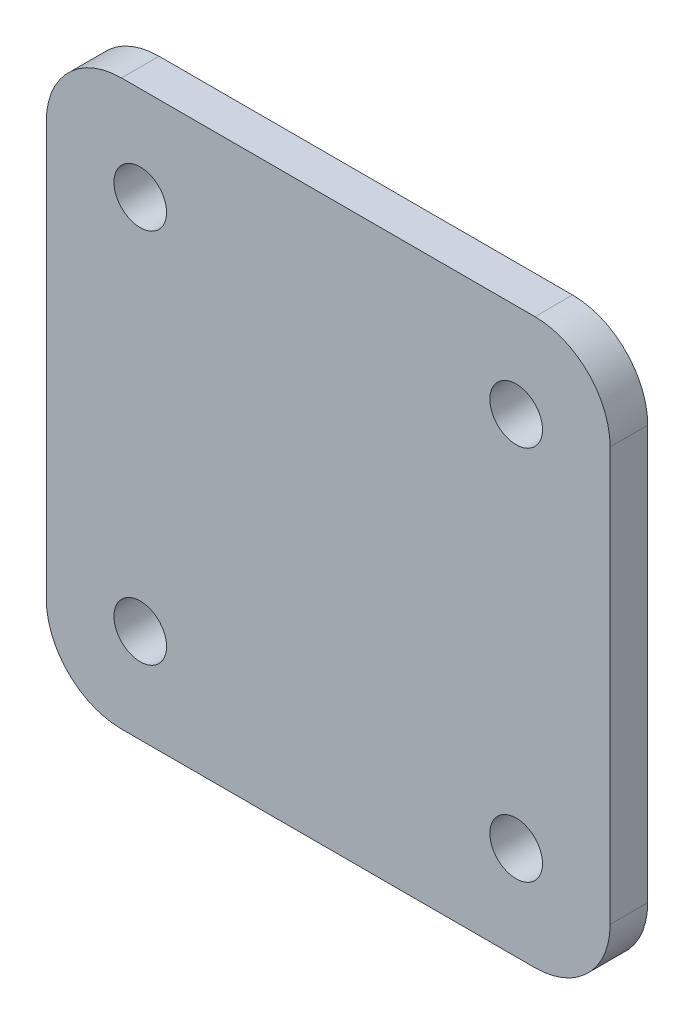
ISO-10303-21;
HEADER;
FILE_DESCRIPTION(('STEP AP214'),'2;1');
FILE_NAME('part.step','',(''),(''),'','','');
FILE_SCHEMA(('AUTOMOTIVE_DESIGN { 1 0 10303 214 1 1 1 1 }'));
ENDSEC;
DATA;
#1=APPLICATION_CONTEXT('core data for automotive mechanical design processes');
#2=APPLICATION_PROTOCOL_DEFINITION('international standard','automotive_design',2000,#1);
#3=PRODUCT_CONTEXT('',#1,'mechanical');
#4=PRODUCT('Part','Part','',(#3));
#5=PRODUCT_RELATED_PRODUCT_CATEGORY('part','',(#4));
#6=PRODUCT_DEFINITION_FORMATION('','',#4);
#7=PRODUCT_DEFINITION_CONTEXT('part definition',#1,'design');
#8=PRODUCT_DEFINITION('design','',#6,#7);
#9=PRODUCT_DEFINITION_SHAPE('','',#8);
#10=(LENGTH_UNIT() NAMED_UNIT(*) SI_UNIT(.MILLI.,.METRE.));
#11=(NAMED_UNIT(*) PLANE_ANGLE_UNIT() SI_UNIT($,.RADIAN.));
#12=(NAMED_UNIT(*) SI_UNIT($,.STERADIAN.) SOLID_ANGLE_UNIT());
#13=UNCERTAINTY_MEASURE_WITH_UNIT(LENGTH_MEASURE(1.E-05),#10,'distance_accuracy_value','');
#14=(GEOMETRIC_REPRESENTATION_CONTEXT(3) GLOBAL_UNCERTAINTY_ASSIGNED_CONTEXT((#13)) GLOBAL_UNIT_ASSIGNED_CONTEXT((#10,
#11,#12)) REPRESENTATION_CONTEXT('',''));
#15=CARTESIAN_POINT('',(0.,0.,0.));
#16=DIRECTION('',(0.,0.,1.));
#17=DIRECTION('',(1.,0.,0.));
#18=AXIS2_PLACEMENT_3D('',#15,#16,#17);
#19=CARTESIAN_POINT('',(-37.5,37.5,5.));
#20=DIRECTION('',(1.,0.,0.));
#21=DIRECTION('',(0.,1.,0.));
#22=AXIS2_PLACEMENT_3D('',#19,#20,#21);
#23=PLANE('',#22);
#24=DIRECTION('',(0.,-1.,0.));
#25=VECTOR('',#24,1.);
#26=CARTESIAN_POINT('',(-37.5,37.5,5.));
#27=LINE('',#26,#25);
#28=CARTESIAN_POINT('',(-37.5,27.5,5.));
#29=VERTEX_POINT('',#28);
#30=CARTESIAN_POINT('',(-37.5,-27.5,5.));
#31=VERTEX_POINT('',#30);
#32=EDGE_CURVE('E133',#29,#31,#27,.T.);
#33=ORIENTED_EDGE('',*,*,#32,.F.);
#34=DIRECTION('',(0.,0.,-1.));
#35=VECTOR('',#34,1.);
#36=CARTESIAN_POINT('',(-37.5,27.5,5.));
#37=LINE('',#36,#35);
#38=CARTESIAN_POINT('',(-37.5,27.5,0.));
#39=VERTEX_POINT('',#38);
#40=EDGE_CURVE('E118',#29,#39,#37,.T.);
#41=ORIENTED_EDGE('',*,*,#40,.T.);
#42=DIRECTION('',(0.,-1.,0.));
#43=VECTOR('',#42,1.);
#44=CARTESIAN_POINT('',(-37.5,37.5,0.));
#45=LINE('',#44,#43);
#46=CARTESIAN_POINT('',(-37.5,-27.5,0.));
#47=VERTEX_POINT('',#46);
#48=EDGE_CURVE('E130',#39,#47,#45,.T.);
#49=ORIENTED_EDGE('',*,*,#48,.T.);
#50=DIRECTION('',(0.,0.,-1.));
#51=VECTOR('',#50,1.);
#52=CARTESIAN_POINT('',(-37.5,-27.5,5.));
#53=LINE('',#52,#51);
#54=EDGE_CURVE('E135',#47,#31,#53,.F.);
#55=ORIENTED_EDGE('',*,*,#54,.T.);
#56=EDGE_LOOP('',(#33,#41,#49,#55));
#57=FACE_BOUND('',#56,.T.);
#58=ADVANCED_FACE('F48',(#57),#23,.F.);
#59=CARTESIAN_POINT('',(-37.5,-37.5,5.));
#60=DIRECTION('',(0.,1.,0.));
#61=DIRECTION('',(-1.,0.,0.));
#62=AXIS2_PLACEMENT_3D('',#59,#60,#61);
#63=PLANE('',#62);
#64=DIRECTION('',(1.,0.,0.));
#65=VECTOR('',#64,1.);
#66=CARTESIAN_POINT('',(-37.5,-37.5,5.));
#67=LINE('',#66,#65);
#68=CARTESIAN_POINT('',(-27.5,-37.5,5.));
#69=VERTEX_POINT('',#68);
#70=CARTESIAN_POINT('',(27.5,-37.5,5.));
#71=VERTEX_POINT('',#70);
#72=EDGE_CURVE('E179',#69,#71,#67,.T.);
#73=ORIENTED_EDGE('',*,*,#72,.F.);
#74=DIRECTION('',(0.,0.,-1.));
#75=VECTOR('',#74,1.);
#76=CARTESIAN_POINT('',(-27.5,-37.5,5.));
#77=LINE('',#76,#75);
#78=CARTESIAN_POINT('',(-27.5,-37.5,0.));
#79=VERTEX_POINT('',#78);
#80=EDGE_CURVE('E172',#69,#79,#77,.T.);
#81=ORIENTED_EDGE('',*,*,#80,.T.);
#82=DIRECTION('',(1.,0.,0.));
#83=VECTOR('',#82,1.);
#84=CARTESIAN_POINT('',(-37.5,-37.5,0.));
#85=LINE('',#84,#83);
#86=CARTESIAN_POINT('',(27.5,-37.5,0.));
#87=VERTEX_POINT('',#86);
#88=EDGE_CURVE('E139',#79,#87,#85,.T.);
#89=ORIENTED_EDGE('',*,*,#88,.T.);
#90=DIRECTION('',(0.,0.,-1.));
#91=VECTOR('',#90,1.);
#92=CARTESIAN_POINT('',(27.5,-37.5,5.));
#93=LINE('',#92,#91);
#94=EDGE_CURVE('E170',#87,#71,#93,.F.);
#95=ORIENTED_EDGE('',*,*,#94,.T.);
#96=EDGE_LOOP('',(#73,#81,#89,#95));
#97=FACE_BOUND('',#96,.T.);
#98=ADVANCED_FACE('F177',(#97),#63,.F.);
#99=CARTESIAN_POINT('',(37.5,37.5,5.));
#100=DIRECTION('',(-1.,0.,0.));
#101=DIRECTION('',(0.,0.,1.));
#102=AXIS2_PLACEMENT_3D('',#99,#100,#101);
#103=PLANE('',#102);
#104=DIRECTION('',(0.,1.,0.));
#105=VECTOR('',#104,1.);
#106=CARTESIAN_POINT('',(37.5,37.5,5.));
#107=LINE('',#106,#105);
#108=CARTESIAN_POINT('',(37.5,-27.5,5.));
#109=VERTEX_POINT('',#108);
#110=CARTESIAN_POINT('',(37.5,27.5,5.));
#111=VERTEX_POINT('',#110);
#112=EDGE_CURVE('E187',#109,#111,#107,.T.);
#113=ORIENTED_EDGE('',*,*,#112,.F.);
#114=DIRECTION('',(0.,0.,-1.));
#115=VECTOR('',#114,1.);
#116=CARTESIAN_POINT('',(37.5,-27.5,5.));
#117=LINE('',#116,#115);
#118=CARTESIAN_POINT('',(37.5,-27.5,0.));
#119=VERTEX_POINT('',#118);
#120=EDGE_CURVE('E13',#109,#119,#117,.T.);
#121=ORIENTED_EDGE('',*,*,#120,.T.);
#122=DIRECTION('',(0.,1.,0.));
#123=VECTOR('',#122,1.);
#124=CARTESIAN_POINT('',(37.5,37.5,0.));
#125=LINE('',#124,#123);
#126=CARTESIAN_POINT('',(37.5,27.5,0.));
#127=VERTEX_POINT('',#126);
#128=EDGE_CURVE('E143',#119,#127,#125,.T.);
#129=ORIENTED_EDGE('',*,*,#128,.T.);
#130=DIRECTION('',(0.,0.,-1.));
#131=VECTOR('',#130,1.);
#132=CARTESIAN_POINT('',(37.5,27.5,5.));
#133=LINE('',#132,#131);
#134=EDGE_CURVE('E56',#127,#111,#133,.F.);
#135=ORIENTED_EDGE('',*,*,#134,.T.);
#136=EDGE_LOOP('',(#113,#121,#129,#135));
#137=FACE_BOUND('',#136,.T.);
#138=ADVANCED_FACE('F186',(#137),#103,.F.);
#139=CARTESIAN_POINT('',(-37.5,37.5,5.));
#140=DIRECTION('',(0.,-1.,0.));
#141=DIRECTION('',(1.,0.,0.));
#142=AXIS2_PLACEMENT_3D('',#139,#140,#141);
#143=PLANE('',#142);
#144=DIRECTION('',(-1.,0.,0.));
#145=VECTOR('',#144,1.);
#146=CARTESIAN_POINT('',(-37.5,37.5,0.));
#147=LINE('',#146,#145);
#148=CARTESIAN_POINT('',(27.5,37.5,0.));
#149=VERTEX_POINT('',#148);
#150=CARTESIAN_POINT('',(-27.5,37.5,0.));
#151=VERTEX_POINT('',#150);
#152=EDGE_CURVE('E153',#149,#151,#147,.T.);
#153=ORIENTED_EDGE('',*,*,#152,.T.);
#154=DIRECTION('',(0.,0.,-1.));
#155=VECTOR('',#154,1.);
#156=CARTESIAN_POINT('',(-27.5,37.5,5.));
#157=LINE('',#156,#155);
#158=CARTESIAN_POINT('',(-27.5,37.5,5.));
#159=VERTEX_POINT('',#158);
#160=EDGE_CURVE('E119',#151,#159,#157,.F.);
#161=ORIENTED_EDGE('',*,*,#160,.T.);
#162=DIRECTION('',(-1.,0.,0.));
#163=VECTOR('',#162,1.);
#164=CARTESIAN_POINT('',(-37.5,37.5,5.));
#165=LINE('',#164,#163);
#166=CARTESIAN_POINT('',(27.5,37.5,5.));
#167=VERTEX_POINT('',#166);
#168=EDGE_CURVE('E149',#167,#159,#165,.T.);
#169=ORIENTED_EDGE('',*,*,#168,.F.);
#170=DIRECTION('',(0.,0.,-1.));
#171=VECTOR('',#170,1.);
#172=CARTESIAN_POINT('',(27.5,37.5,5.));
#173=LINE('',#172,#171);
#174=EDGE_CURVE('E124',#167,#149,#173,.T.);
#175=ORIENTED_EDGE('',*,*,#174,.T.);
#176=EDGE_LOOP('',(#153,#161,#169,#175));
#177=FACE_BOUND('',#176,.T.);
#178=ADVANCED_FACE('F219',(#177),#143,.F.);
#179=CARTESIAN_POINT('',(0.,0.,5.));
#180=DIRECTION('',(0.,0.,1.));
#181=DIRECTION('',(1.,0.,0.));
#182=AXIS2_PLACEMENT_3D('',#179,#180,#181);
#183=PLANE('',#182);
#184=CARTESIAN_POINT('',(-25.,25.,5.));
#185=DIRECTION('',(0.,0.,1.));
#186=DIRECTION('',(1.,0.,0.));
#187=AXIS2_PLACEMENT_3D('',#184,#185,#186);
#188=CIRCLE('',#187,3.5);
#189=CARTESIAN_POINT('',(-21.5,25.,5.));
#190=VERTEX_POINT('',#189);
#191=EDGE_CURVE('E210',#190,#190,#188,.T.);
#192=ORIENTED_EDGE('',*,*,#191,.F.);
#193=EDGE_LOOP('',(#192));
#194=FACE_BOUND('',#193,.T.);
#195=CARTESIAN_POINT('',(-25.,-25.,5.));
#196=DIRECTION('',(0.,0.,1.));
#197=DIRECTION('',(1.,0.,0.));
#198=AXIS2_PLACEMENT_3D('',#195,#196,#197);
#199=CIRCLE('',#198,3.5);
#200=CARTESIAN_POINT('',(-21.5,-25.,5.));
#201=VERTEX_POINT('',#200);
#202=EDGE_CURVE('E204',#201,#201,#199,.T.);
#203=ORIENTED_EDGE('',*,*,#202,.F.);
#204=EDGE_LOOP('',(#203));
#205=FACE_BOUND('',#204,.T.);
#206=CARTESIAN_POINT('',(25.,-25.,5.));
#207=DIRECTION('',(0.,0.,1.));
#208=DIRECTION('',(1.,0.,0.));
#209=AXIS2_PLACEMENT_3D('',#206,#207,#208);
#210=CIRCLE('',#209,3.5);
#211=CARTESIAN_POINT('',(28.5,-25.,5.));
#212=VERTEX_POINT('',#211);
#213=EDGE_CURVE('E198',#212,#212,#210,.T.);
#214=ORIENTED_EDGE('',*,*,#213,.F.);
#215=EDGE_LOOP('',(#214));
#216=FACE_BOUND('',#215,.T.);
#217=CARTESIAN_POINT('',(25.,25.,5.));
#218=DIRECTION('',(0.,0.,1.));
#219=DIRECTION('',(1.,0.,0.));
#220=AXIS2_PLACEMENT_3D('',#217,#218,#219);
#221=CIRCLE('',#220,3.5);
#222=CARTESIAN_POINT('',(28.5,25.,5.));
#223=VERTEX_POINT('',#222);
#224=EDGE_CURVE('E146',#223,#223,#221,.T.);
#225=ORIENTED_EDGE('',*,*,#224,.F.);
#226=EDGE_LOOP('',(#225));
#227=FACE_BOUND('',#226,.T.);
#228=ORIENTED_EDGE('',*,*,#168,.T.);
#229=CARTESIAN_POINT('',(-27.5,27.5,5.));
#230=DIRECTION('',(0.,0.,1.));
#231=DIRECTION('',(1.,0.,0.));
#232=AXIS2_PLACEMENT_3D('',#229,#230,#231);
#233=CIRCLE('',#232,10.);
#234=EDGE_CURVE('E168',#159,#29,#233,.T.);
#235=ORIENTED_EDGE('',*,*,#234,.T.);
#236=ORIENTED_EDGE('',*,*,#32,.T.);
#237=CARTESIAN_POINT('',(-27.5,-27.5,5.));
#238=DIRECTION('',(0.,0.,1.));
#239=DIRECTION('',(1.,0.,0.));
#240=AXIS2_PLACEMENT_3D('',#237,#238,#239);
#241=CIRCLE('',#240,10.);
#242=EDGE_CURVE('E166',#31,#69,#241,.T.);
#243=ORIENTED_EDGE('',*,*,#242,.T.);
#244=ORIENTED_EDGE('',*,*,#72,.T.);
#245=CARTESIAN_POINT('',(27.5,-27.5,5.));
#246=DIRECTION('',(0.,0.,1.));
#247=DIRECTION('',(1.,0.,0.));
#248=AXIS2_PLACEMENT_3D('',#245,#246,#247);
#249=CIRCLE('',#248,10.);
#250=EDGE_CURVE('E69',#71,#109,#249,.T.);
#251=ORIENTED_EDGE('',*,*,#250,.T.);
#252=ORIENTED_EDGE('',*,*,#112,.T.);
#253=CARTESIAN_POINT('',(27.5,27.5,5.));
#254=DIRECTION('',(0.,0.,1.));
#255=DIRECTION('',(1.,0.,0.));
#256=AXIS2_PLACEMENT_3D('',#253,#254,#255);
#257=CIRCLE('',#256,10.);
#258=EDGE_CURVE('E163',#111,#167,#257,.T.);
#259=ORIENTED_EDGE('',*,*,#258,.T.);
#260=EDGE_LOOP('',(#228,#235,#236,#243,#244,#251,#252,#259));
#261=FACE_BOUND('',#260,.T.);
#262=ADVANCED_FACE('F216',(#194,#205,#216,#227,#261),#183,.T.);
#263=CARTESIAN_POINT('',(0.,0.,0.));
#264=DIRECTION('',(0.,0.,1.));
#265=DIRECTION('',(1.,0.,0.));
#266=AXIS2_PLACEMENT_3D('',#263,#264,#265);
#267=PLANE('',#266);
#268=CARTESIAN_POINT('',(-25.,25.,0.));
#269=DIRECTION('',(0.,0.,1.));
#270=DIRECTION('',(1.,0.,0.));
#271=AXIS2_PLACEMENT_3D('',#268,#269,#270);
#272=CIRCLE('',#271,3.5);
#273=CARTESIAN_POINT('',(-21.5,25.,0.));
#274=VERTEX_POINT('',#273);
#275=EDGE_CURVE('E207',#274,#274,#272,.T.);
#276=ORIENTED_EDGE('',*,*,#275,.T.);
#277=EDGE_LOOP('',(#276));
#278=FACE_BOUND('',#277,.T.);
#279=CARTESIAN_POINT('',(-25.,-25.,0.));
#280=DIRECTION('',(0.,0.,1.));
#281=DIRECTION('',(1.,0.,0.));
#282=AXIS2_PLACEMENT_3D('',#279,#280,#281);
#283=CIRCLE('',#282,3.5);
#284=CARTESIAN_POINT('',(-21.5,-25.,0.));
#285=VERTEX_POINT('',#284);
#286=EDGE_CURVE('E201',#285,#285,#283,.T.);
#287=ORIENTED_EDGE('',*,*,#286,.T.);
#288=EDGE_LOOP('',(#287));
#289=FACE_BOUND('',#288,.T.);
#290=CARTESIAN_POINT('',(25.,-25.,0.));
#291=DIRECTION('',(0.,0.,1.));
#292=DIRECTION('',(1.,0.,0.));
#293=AXIS2_PLACEMENT_3D('',#290,#291,#292);
#294=CIRCLE('',#293,3.5);
#295=CARTESIAN_POINT('',(28.5,-25.,0.));
#296=VERTEX_POINT('',#295);
#297=EDGE_CURVE('E195',#296,#296,#294,.T.);
#298=ORIENTED_EDGE('',*,*,#297,.T.);
#299=EDGE_LOOP('',(#298));
#300=FACE_BOUND('',#299,.T.);
#301=CARTESIAN_POINT('',(25.,25.,0.));
#302=DIRECTION('',(0.,0.,1.));
#303=DIRECTION('',(1.,0.,0.));
#304=AXIS2_PLACEMENT_3D('',#301,#302,#303);
#305=CIRCLE('',#304,3.5);
#306=CARTESIAN_POINT('',(28.5,25.,0.));
#307=VERTEX_POINT('',#306);
#308=EDGE_CURVE('E140',#307,#307,#305,.T.);
#309=ORIENTED_EDGE('',*,*,#308,.T.);
#310=EDGE_LOOP('',(#309));
#311=FACE_BOUND('',#310,.T.);
#312=ORIENTED_EDGE('',*,*,#48,.F.);
#313=CARTESIAN_POINT('',(-27.5,27.5,0.));
#314=DIRECTION('',(0.,0.,1.));
#315=DIRECTION('',(1.,0.,0.));
#316=AXIS2_PLACEMENT_3D('',#313,#314,#315);
#317=CIRCLE('',#316,10.);
#318=EDGE_CURVE('E114',#39,#151,#317,.F.);
#319=ORIENTED_EDGE('',*,*,#318,.T.);
#320=ORIENTED_EDGE('',*,*,#152,.F.);
#321=CARTESIAN_POINT('',(27.5,27.5,0.));
#322=DIRECTION('',(0.,0.,1.));
#323=DIRECTION('',(1.,0.,0.));
#324=AXIS2_PLACEMENT_3D('',#321,#322,#323);
#325=CIRCLE('',#324,10.);
#326=EDGE_CURVE('E134',#149,#127,#325,.F.);
#327=ORIENTED_EDGE('',*,*,#326,.T.);
#328=ORIENTED_EDGE('',*,*,#128,.F.);
#329=CARTESIAN_POINT('',(27.5,-27.5,0.));
#330=DIRECTION('',(0.,0.,1.));
#331=DIRECTION('',(1.,0.,0.));
#332=AXIS2_PLACEMENT_3D('',#329,#330,#331);
#333=CIRCLE('',#332,10.);
#334=EDGE_CURVE('E157',#119,#87,#333,.F.);
#335=ORIENTED_EDGE('',*,*,#334,.T.);
#336=ORIENTED_EDGE('',*,*,#88,.F.);
#337=CARTESIAN_POINT('',(-27.5,-27.5,0.));
#338=DIRECTION('',(0.,0.,1.));
#339=DIRECTION('',(1.,0.,0.));
#340=AXIS2_PLACEMENT_3D('',#337,#338,#339);
#341=CIRCLE('',#340,10.);
#342=EDGE_CURVE('E125',#79,#47,#341,.F.);
#343=ORIENTED_EDGE('',*,*,#342,.T.);
#344=EDGE_LOOP('',(#312,#319,#320,#327,#328,#335,#336,#343));
#345=FACE_BOUND('',#344,.T.);
#346=ADVANCED_FACE('F137',(#278,#289,#300,#311,#345),#267,.F.);
#347=CARTESIAN_POINT('',(25.,25.,5.));
#348=DIRECTION('',(0.,0.,1.));
#349=DIRECTION('',(1.,0.,0.));
#350=AXIS2_PLACEMENT_3D('',#347,#348,#349);
#351=CYLINDRICAL_SURFACE('',#350,3.5);
#352=ORIENTED_EDGE('',*,*,#308,.F.);
#353=EDGE_LOOP('',(#352));
#354=FACE_BOUND('',#353,.T.);
#355=ORIENTED_EDGE('',*,*,#224,.T.);
#356=EDGE_LOOP('',(#355));
#357=FACE_BOUND('',#356,.T.);
#358=ADVANCED_FACE('F293',(#354,#357),#351,.F.);
#359=CARTESIAN_POINT('',(25.,-25.,5.));
#360=DIRECTION('',(0.,0.,1.));
#361=DIRECTION('',(1.,0.,0.));
#362=AXIS2_PLACEMENT_3D('',#359,#360,#361);
#363=CYLINDRICAL_SURFACE('',#362,3.5);
#364=ORIENTED_EDGE('',*,*,#297,.F.);
#365=EDGE_LOOP('',(#364));
#366=FACE_BOUND('',#365,.T.);
#367=ORIENTED_EDGE('',*,*,#213,.T.);
#368=EDGE_LOOP('',(#367));
#369=FACE_BOUND('',#368,.T.);
#370=ADVANCED_FACE('F284',(#366,#369),#363,.F.);
#371=CARTESIAN_POINT('',(-25.,-25.,5.));
#372=DIRECTION('',(0.,0.,1.));
#373=DIRECTION('',(1.,0.,0.));
#374=AXIS2_PLACEMENT_3D('',#371,#372,#373);
#375=CYLINDRICAL_SURFACE('',#374,3.5);
#376=ORIENTED_EDGE('',*,*,#286,.F.);
#377=EDGE_LOOP('',(#376));
#378=FACE_BOUND('',#377,.T.);
#379=ORIENTED_EDGE('',*,*,#202,.T.);
#380=EDGE_LOOP('',(#379));
#381=FACE_BOUND('',#380,.T.);
#382=ADVANCED_FACE('F275',(#378,#381),#375,.F.);
#383=CARTESIAN_POINT('',(-25.,25.,5.));
#384=DIRECTION('',(0.,0.,1.));
#385=DIRECTION('',(1.,0.,0.));
#386=AXIS2_PLACEMENT_3D('',#383,#384,#385);
#387=CYLINDRICAL_SURFACE('',#386,3.5);
#388=ORIENTED_EDGE('',*,*,#275,.F.);
#389=EDGE_LOOP('',(#388));
#390=FACE_BOUND('',#389,.T.);
#391=ORIENTED_EDGE('',*,*,#191,.T.);
#392=EDGE_LOOP('',(#391));
#393=FACE_BOUND('',#392,.T.);
#394=ADVANCED_FACE('F214',(#390,#393),#387,.F.);
#395=CARTESIAN_POINT('',(-27.5,27.5,5.));
#396=DIRECTION('',(0.,0.,-1.));
#397=DIRECTION('',(-1.,0.,0.));
#398=AXIS2_PLACEMENT_3D('',#395,#396,#397);
#399=CYLINDRICAL_SURFACE('',#398,10.);
#400=ORIENTED_EDGE('',*,*,#234,.F.);
#401=ORIENTED_EDGE('',*,*,#160,.F.);
#402=ORIENTED_EDGE('',*,*,#318,.F.);
#403=ORIENTED_EDGE('',*,*,#40,.F.);
#404=EDGE_LOOP('',(#400,#401,#402,#403));
#405=FACE_BOUND('',#404,.T.);
#406=ADVANCED_FACE('F117',(#405),#399,.T.);
#407=CARTESIAN_POINT('',(-27.5,-27.5,5.));
#408=DIRECTION('',(0.,0.,-1.));
#409=DIRECTION('',(-1.,0.,0.));
#410=AXIS2_PLACEMENT_3D('',#407,#408,#409);
#411=CYLINDRICAL_SURFACE('',#410,10.);
#412=ORIENTED_EDGE('',*,*,#242,.F.);
#413=ORIENTED_EDGE('',*,*,#54,.F.);
#414=ORIENTED_EDGE('',*,*,#342,.F.);
#415=ORIENTED_EDGE('',*,*,#80,.F.);
#416=EDGE_LOOP('',(#412,#413,#414,#415));
#417=FACE_BOUND('',#416,.T.);
#418=ADVANCED_FACE('F234',(#417),#411,.T.);
#419=CARTESIAN_POINT('',(27.5,-27.5,5.));
#420=DIRECTION('',(0.,0.,-1.));
#421=DIRECTION('',(-1.,0.,0.));
#422=AXIS2_PLACEMENT_3D('',#419,#420,#421);
#423=CYLINDRICAL_SURFACE('',#422,10.);
#424=ORIENTED_EDGE('',*,*,#250,.F.);
#425=ORIENTED_EDGE('',*,*,#94,.F.);
#426=ORIENTED_EDGE('',*,*,#334,.F.);
#427=ORIENTED_EDGE('',*,*,#120,.F.);
#428=EDGE_LOOP('',(#424,#425,#426,#427));
#429=FACE_BOUND('',#428,.T.);
#430=ADVANCED_FACE('F185',(#429),#423,.T.);
#431=CARTESIAN_POINT('',(27.5,27.5,5.));
#432=DIRECTION('',(0.,0.,-1.));
#433=DIRECTION('',(-1.,0.,0.));
#434=AXIS2_PLACEMENT_3D('',#431,#432,#433);
#435=CYLINDRICAL_SURFACE('',#434,10.);
#436=ORIENTED_EDGE('',*,*,#258,.F.);
#437=ORIENTED_EDGE('',*,*,#134,.F.);
#438=ORIENTED_EDGE('',*,*,#326,.F.);
#439=ORIENTED_EDGE('',*,*,#174,.F.);
#440=EDGE_LOOP('',(#436,#437,#438,#439));
#441=FACE_BOUND('',#440,.T.);
#442=ADVANCED_FACE('F50',(#441),#435,.T.);
#443=CLOSED_SHELL('',(#58,#98,#138,#178,#262,#346,#358,#370,#382,#394,#406,#418,#430,#442));
#444=MANIFOLD_SOLID_BREP('B2',#443);
#445=ADVANCED_BREP_SHAPE_REPRESENTATION('',(#18,#444),#14);
#446=SHAPE_DEFINITION_REPRESENTATION(#9,#445);
ENDSEC;
END-ISO-10303-21;
